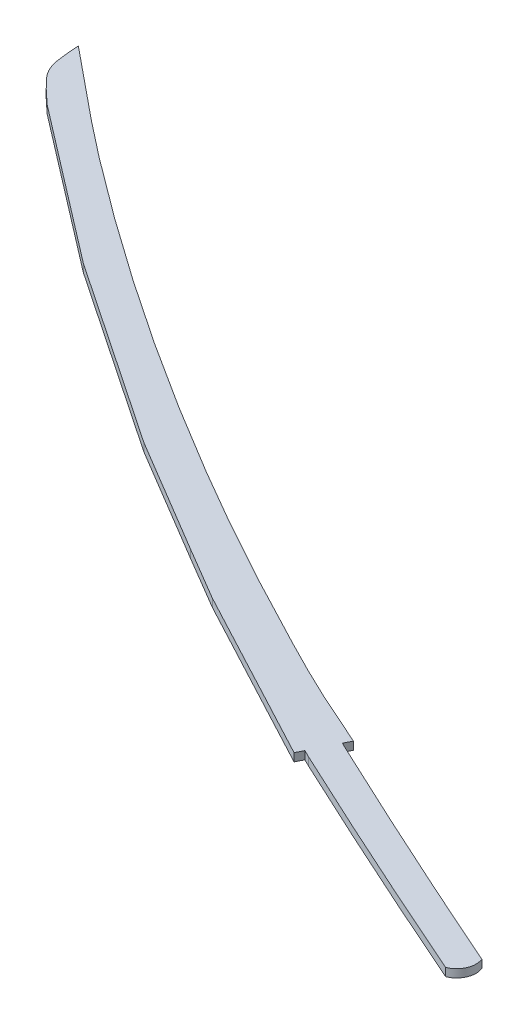
ISO-10303-21;
HEADER;
FILE_DESCRIPTION(('STEP AP214'),'2;1');
FILE_NAME('part.step','',(''),(''),'','','');
FILE_SCHEMA(('AUTOMOTIVE_DESIGN { 1 0 10303 214 1 1 1 1 }'));
ENDSEC;
DATA;
#1=APPLICATION_CONTEXT('core data for automotive mechanical design processes');
#2=APPLICATION_PROTOCOL_DEFINITION('international standard','automotive_design',2000,#1);
#3=PRODUCT_CONTEXT('',#1,'mechanical');
#4=PRODUCT('Part','Part','',(#3));
#5=PRODUCT_RELATED_PRODUCT_CATEGORY('part','',(#4));
#6=PRODUCT_DEFINITION_FORMATION('','',#4);
#7=PRODUCT_DEFINITION_CONTEXT('part definition',#1,'design');
#8=PRODUCT_DEFINITION('design','',#6,#7);
#9=PRODUCT_DEFINITION_SHAPE('','',#8);
#10=(LENGTH_UNIT() NAMED_UNIT(*) SI_UNIT(.MILLI.,.METRE.));
#11=(NAMED_UNIT(*) PLANE_ANGLE_UNIT() SI_UNIT($,.RADIAN.));
#12=(NAMED_UNIT(*) SI_UNIT($,.STERADIAN.) SOLID_ANGLE_UNIT());
#13=UNCERTAINTY_MEASURE_WITH_UNIT(LENGTH_MEASURE(1.E-05),#10,'distance_accuracy_value','');
#14=(GEOMETRIC_REPRESENTATION_CONTEXT(3) GLOBAL_UNCERTAINTY_ASSIGNED_CONTEXT((#13)) GLOBAL_UNIT_ASSIGNED_CONTEXT((#10,
#11,#12)) REPRESENTATION_CONTEXT('',''));
#15=CARTESIAN_POINT('',(0.,0.,0.));
#16=DIRECTION('',(0.,0.,1.));
#17=DIRECTION('',(1.,0.,0.));
#18=AXIS2_PLACEMENT_3D('',#15,#16,#17);
#19=CARTESIAN_POINT('',(42.035523096357,6.35,65.1986253078703));
#20=CARTESIAN_POINT('',(34.8092546586514,6.35,57.7833745415171));
#21=CARTESIAN_POINT('',(26.0365702999491,6.35,51.6099033801397));
#22=CARTESIAN_POINT('',(20.35671778324,6.35,42.9528730088102));
#23=CARTESIAN_POINT('',(14.7218994955774,6.35,34.3644822170223));
#24=CARTESIAN_POINT('',(15.1679157096741,6.35,22.9825376753222));
#25=CARTESIAN_POINT('',(14.2195990873911,6.35,12.7545208044252));
#26=B_SPLINE_CURVE_WITH_KNOTS('',3,(#19,#20,#21,#22,#23,#24,#25),.UNSPECIFIED.,.F.,.F.,(4,3,4),
(0.,1.,2.),.UNSPECIFIED.);
#27=DIRECTION('',(0.,-1.,0.));
#28=VECTOR('',#27,1.);
#29=SURFACE_OF_LINEAR_EXTRUSION('',#26,#28);
#30=CARTESIAN_POINT('',(42.035523096357,0.,65.1986253078703));
#31=CARTESIAN_POINT('',(34.8092546586514,0.,57.7833745415171));
#32=CARTESIAN_POINT('',(26.0365702999491,0.,51.6099033801397));
#33=CARTESIAN_POINT('',(20.35671778324,0.,42.9528730088102));
#34=CARTESIAN_POINT('',(14.7218994955774,0.,34.3644822170223));
#35=CARTESIAN_POINT('',(15.1679157096741,0.,22.9825376753222));
#36=CARTESIAN_POINT('',(14.2195990873911,0.,12.7545208044252));
#37=B_SPLINE_CURVE_WITH_KNOTS('',3,(#30,#31,#32,#33,#34,#35,#36),.UNSPECIFIED.,.F.,.F.,(4,3,4),
(0.,1.,2.),.UNSPECIFIED.);
#38=CARTESIAN_POINT('',(42.035523096357,0.,65.1986253078703));
#39=VERTEX_POINT('',#38);
#40=CARTESIAN_POINT('',(14.2195990873911,0.,12.7545208044252));
#41=VERTEX_POINT('',#40);
#42=EDGE_CURVE('E318',#39,#41,#37,.T.);
#43=ORIENTED_EDGE('',*,*,#42,.F.);
#44=DIRECTION('',(0.,-1.,0.));
#45=VECTOR('',#44,1.);
#46=CARTESIAN_POINT('',(42.035523096357,6.35,65.1986253078703));
#47=LINE('',#46,#45);
#48=CARTESIAN_POINT('',(42.035523096357,6.35,65.1986253078703));
#49=VERTEX_POINT('',#48);
#50=EDGE_CURVE('E12',#49,#39,#47,.T.);
#51=ORIENTED_EDGE('',*,*,#50,.F.);
#52=CARTESIAN_POINT('',(14.2195990873911,6.35,12.7545208044252));
#53=VERTEX_POINT('',#52);
#54=EDGE_CURVE('E243',#49,#53,#26,.T.);
#55=ORIENTED_EDGE('',*,*,#54,.T.);
#56=DIRECTION('',(0.,-1.,0.));
#57=VECTOR('',#56,1.);
#58=CARTESIAN_POINT('',(14.2195990873911,6.35,12.7545208044252));
#59=LINE('',#58,#57);
#60=EDGE_CURVE('E62',#53,#41,#59,.T.);
#61=ORIENTED_EDGE('',*,*,#60,.T.);
#62=EDGE_LOOP('',(#43,#51,#55,#61));
#63=FACE_BOUND('',#62,.T.);
#64=ADVANCED_FACE('F44',(#63),#29,.T.);
#65=CARTESIAN_POINT('',(-15.9135943433382,6.35,20.7445061173763));
#66=DIRECTION('',(-0.608659712115637,0.,0.793431380049535));
#67=DIRECTION('',(0.793431380049535,0.,0.608659712115637));
#68=AXIS2_PLACEMENT_3D('',#65,#66,#67);
#69=PLANE('',#68);
#70=DIRECTION('',(-0.793431380049535,0.,-0.608659712115637));
#71=VECTOR('',#70,1.);
#72=CARTESIAN_POINT('',(-15.9135943433382,0.,20.7445061173763));
#73=LINE('',#72,#71);
#74=CARTESIAN_POINT('',(164.740942363501,0.,159.328813556166));
#75=VERTEX_POINT('',#74);
#76=EDGE_CURVE('E315',#75,#39,#73,.T.);
#77=ORIENTED_EDGE('',*,*,#76,.F.);
#78=DIRECTION('',(0.,-1.,0.));
#79=VECTOR('',#78,1.);
#80=CARTESIAN_POINT('',(164.740942363501,6.35,159.328813556166));
#81=LINE('',#80,#79);
#82=CARTESIAN_POINT('',(164.740942363501,6.35,159.328813556166));
#83=VERTEX_POINT('',#82);
#84=EDGE_CURVE('E54',#83,#75,#81,.T.);
#85=ORIENTED_EDGE('',*,*,#84,.F.);
#86=DIRECTION('',(-0.793431380049535,0.,-0.608659712115637));
#87=VECTOR('',#86,1.);
#88=CARTESIAN_POINT('',(-15.9135943433382,6.35,20.7445061173763));
#89=LINE('',#88,#87);
#90=EDGE_CURVE('E239',#83,#49,#89,.T.);
#91=ORIENTED_EDGE('',*,*,#90,.T.);
#92=ORIENTED_EDGE('',*,*,#50,.T.);
#93=EDGE_LOOP('',(#77,#85,#91,#92));
#94=FACE_BOUND('',#93,.T.);
#95=ADVANCED_FACE('F316',(#94),#69,.T.);
#96=CARTESIAN_POINT('',(-22.3979928883783,6.35,33.2437091702958));
#97=DIRECTION('',(-0.558761224486034,0.,0.829328580244808));
#98=DIRECTION('',(0.829328580244808,0.,0.558761224486034));
#99=AXIS2_PLACEMENT_3D('',#96,#97,#98);
#100=PLANE('',#99);
#101=DIRECTION('',(-0.829328580244808,0.,-0.558761224486034));
#102=VECTOR('',#101,1.);
#103=CARTESIAN_POINT('',(-22.3979928883783,0.,33.2437091702958));
#104=LINE('',#103,#102);
#105=CARTESIAN_POINT('',(311.103839714367,0.,257.94100863927));
#106=VERTEX_POINT('',#105);
#107=EDGE_CURVE('E309',#106,#75,#104,.T.);
#108=ORIENTED_EDGE('',*,*,#107,.F.);
#109=DIRECTION('',(0.,-1.,0.));
#110=VECTOR('',#109,1.);
#111=CARTESIAN_POINT('',(311.103839714367,6.35,257.94100863927));
#112=LINE('',#111,#110);
#113=CARTESIAN_POINT('',(311.103839714367,6.35,257.94100863927));
#114=VERTEX_POINT('',#113);
#115=EDGE_CURVE('E300',#114,#106,#112,.T.);
#116=ORIENTED_EDGE('',*,*,#115,.F.);
#117=DIRECTION('',(-0.829328580244808,0.,-0.558761224486034));
#118=VECTOR('',#117,1.);
#119=CARTESIAN_POINT('',(-22.3979928883783,6.35,33.2437091702958));
#120=LINE('',#119,#118);
#121=EDGE_CURVE('E233',#114,#83,#120,.T.);
#122=ORIENTED_EDGE('',*,*,#121,.T.);
#123=ORIENTED_EDGE('',*,*,#84,.T.);
#124=EDGE_LOOP('',(#108,#116,#122,#123));
#125=FACE_BOUND('',#124,.T.);
#126=ADVANCED_FACE('F307',(#125),#100,.T.);
#127=CARTESIAN_POINT('',(-31.8381402136138,6.35,53.374498192462));
#128=DIRECTION('',(-0.51228684881937,0.,0.858814406333941));
#129=DIRECTION('',(0.858814406333941,0.,0.51228684881937));
#130=AXIS2_PLACEMENT_3D('',#127,#128,#129);
#131=PLANE('',#130);
#132=DIRECTION('',(-0.858814406333941,0.,-0.51228684881937));
#133=VECTOR('',#132,1.);
#134=CARTESIAN_POINT('',(-31.8381402136138,0.,53.374498192462));
#135=LINE('',#134,#133);
#136=CARTESIAN_POINT('',(402.295387023258,0.,312.337197228203));
#137=VERTEX_POINT('',#136);
#138=EDGE_CURVE('E323',#137,#106,#135,.T.);
#139=ORIENTED_EDGE('',*,*,#138,.F.);
#140=DIRECTION('',(0.,-1.,0.));
#141=VECTOR('',#140,1.);
#142=CARTESIAN_POINT('',(402.295387023258,6.35,312.337197228203));
#143=LINE('',#142,#141);
#144=CARTESIAN_POINT('',(402.295387023258,6.35,312.337197228203));
#145=VERTEX_POINT('',#144);
#146=EDGE_CURVE('E297',#145,#137,#143,.T.);
#147=ORIENTED_EDGE('',*,*,#146,.F.);
#148=DIRECTION('',(-0.858814406333941,0.,-0.51228684881937));
#149=VECTOR('',#148,1.);
#150=CARTESIAN_POINT('',(-31.8381402136138,6.35,53.374498192462));
#151=LINE('',#150,#149);
#152=EDGE_CURVE('E228',#145,#114,#151,.T.);
#153=ORIENTED_EDGE('',*,*,#152,.T.);
#154=ORIENTED_EDGE('',*,*,#115,.T.);
#155=EDGE_LOOP('',(#139,#147,#153,#154));
#156=FACE_BOUND('',#155,.T.);
#157=ADVANCED_FACE('F393',(#156),#131,.T.);
#158=CARTESIAN_POINT('',(-32.6831092042224,6.35,55.3113653613439));
#159=DIRECTION('',(0.508719166380983,0.,-0.860932523347003));
#160=DIRECTION('',(-0.860932523347003,0.,-0.508719166380983));
#161=AXIS2_PLACEMENT_3D('',#158,#159,#160);
#162=PLANE('',#161);
#163=DIRECTION('',(0.860932523347003,0.,0.508719166380983));
#164=VECTOR('',#163,1.);
#165=CARTESIAN_POINT('',(-32.6831092042224,0.,55.3113653613439));
#166=LINE('',#165,#164);
#167=CARTESIAN_POINT('',(444.65812899431,0.,337.36905303189));
#168=VERTEX_POINT('',#167);
#169=EDGE_CURVE('E327',#137,#168,#166,.T.);
#170=ORIENTED_EDGE('',*,*,#169,.T.);
#171=DIRECTION('',(0.,-1.,0.));
#172=VECTOR('',#171,1.);
#173=CARTESIAN_POINT('',(444.65812899431,6.35,337.36905303189));
#174=LINE('',#173,#172);
#175=CARTESIAN_POINT('',(444.65812899431,6.35,337.36905303189));
#176=VERTEX_POINT('',#175);
#177=EDGE_CURVE('E293',#176,#168,#174,.T.);
#178=ORIENTED_EDGE('',*,*,#177,.F.);
#179=DIRECTION('',(0.860932523347003,0.,0.508719166380983));
#180=VECTOR('',#179,1.);
#181=CARTESIAN_POINT('',(-32.6831092042224,6.35,55.3113653613439));
#182=LINE('',#181,#180);
#183=EDGE_CURVE('E224',#145,#176,#182,.T.);
#184=ORIENTED_EDGE('',*,*,#183,.F.);
#185=ORIENTED_EDGE('',*,*,#146,.T.);
#186=EDGE_LOOP('',(#170,#178,#184,#185));
#187=FACE_BOUND('',#186,.T.);
#188=ADVANCED_FACE('F390',(#187),#162,.F.);
#189=CARTESIAN_POINT('',(-41.7724510207591,6.35,78.4898930434949));
#190=DIRECTION('',(0.469810277858939,0.,-0.882767411506625));
#191=DIRECTION('',(-0.882767411506625,0.,-0.469810277858939));
#192=AXIS2_PLACEMENT_3D('',#189,#190,#191);
#193=PLANE('',#192);
#194=DIRECTION('',(0.882767411506625,0.,0.469810277858939));
#195=VECTOR('',#194,1.);
#196=CARTESIAN_POINT('',(-41.7724510207591,0.,78.4898930434949));
#197=LINE('',#196,#195);
#198=CARTESIAN_POINT('',(582.444322769918,0.,410.699093469567));
#199=VERTEX_POINT('',#198);
#200=EDGE_CURVE('E332',#168,#199,#197,.T.);
#201=ORIENTED_EDGE('',*,*,#200,.T.);
#202=DIRECTION('',(0.,-1.,0.));
#203=VECTOR('',#202,1.);
#204=CARTESIAN_POINT('',(582.444322769918,6.35,410.699093469567));
#205=LINE('',#204,#203);
#206=CARTESIAN_POINT('',(582.444322769918,6.35,410.699093469567));
#207=VERTEX_POINT('',#206);
#208=EDGE_CURVE('E289',#207,#199,#205,.T.);
#209=ORIENTED_EDGE('',*,*,#208,.F.);
#210=DIRECTION('',(0.882767411506625,0.,0.469810277858939));
#211=VECTOR('',#210,1.);
#212=CARTESIAN_POINT('',(-41.7724510207591,6.35,78.4898930434949));
#213=LINE('',#212,#211);
#214=EDGE_CURVE('E221',#176,#207,#213,.T.);
#215=ORIENTED_EDGE('',*,*,#214,.F.);
#216=ORIENTED_EDGE('',*,*,#177,.T.);
#217=EDGE_LOOP('',(#201,#209,#215,#216));
#218=FACE_BOUND('',#217,.T.);
#219=ADVANCED_FACE('F385',(#218),#193,.F.);
#220=CARTESIAN_POINT('',(631.446830461723,6.35,311.302169059645));
#221=DIRECTION('',(-0.896925106405758,0.,-0.442182488910428));
#222=DIRECTION('',(-0.442182488910428,0.,0.896925106405758));
#223=AXIS2_PLACEMENT_3D('',#220,#221,#222);
#224=PLANE('',#223);
#225=DIRECTION('',(0.442182488910428,0.,-0.896925106405758));
#226=VECTOR('',#225,1.);
#227=CARTESIAN_POINT('',(631.446830461723,0.,311.302169059645));
#228=LINE('',#227,#226);
#229=CARTESIAN_POINT('',(585.262595532021,0.,404.982495321914));
#230=VERTEX_POINT('',#229);
#231=EDGE_CURVE('E335',#199,#230,#228,.T.);
#232=ORIENTED_EDGE('',*,*,#231,.T.);
#233=DIRECTION('',(0.,-1.,0.));
#234=VECTOR('',#233,1.);
#235=CARTESIAN_POINT('',(585.262595532021,6.35,404.982495321914));
#236=LINE('',#235,#234);
#237=CARTESIAN_POINT('',(585.262595532021,6.35,404.982495321914));
#238=VERTEX_POINT('',#237);
#239=EDGE_CURVE('E285',#238,#230,#236,.T.);
#240=ORIENTED_EDGE('',*,*,#239,.F.);
#241=DIRECTION('',(0.442182488910428,0.,-0.896925106405758));
#242=VECTOR('',#241,1.);
#243=CARTESIAN_POINT('',(631.446830461723,6.35,311.302169059645));
#244=LINE('',#243,#242);
#245=EDGE_CURVE('E213',#207,#238,#244,.T.);
#246=ORIENTED_EDGE('',*,*,#245,.F.);
#247=ORIENTED_EDGE('',*,*,#208,.T.);
#248=EDGE_LOOP('',(#232,#240,#246,#247));
#249=FACE_BOUND('',#248,.T.);
#250=ADVANCED_FACE('F381',(#249),#224,.F.);
#251=CARTESIAN_POINT('',(-46.1842349286018,6.35,93.6803262588445));
#252=DIRECTION('',(0.442182488914961,0.,-0.896925106403523));
#253=DIRECTION('',(-0.896925106403523,0.,-0.442182488914961));
#254=AXIS2_PLACEMENT_3D('',#251,#252,#253);
#255=PLANE('',#254);
#256=DIRECTION('',(0.896925106403523,0.,0.442182488914961));
#257=VECTOR('',#256,1.);
#258=CARTESIAN_POINT('',(-46.1842349286018,0.,93.6803262588445));
#259=LINE('',#258,#257);
#260=CARTESIAN_POINT('',(591.036734946634,0.,407.829135826754));
#261=VERTEX_POINT('',#260);
#262=EDGE_CURVE('E338',#230,#261,#259,.T.);
#263=ORIENTED_EDGE('',*,*,#262,.T.);
#264=DIRECTION('',(0.,-1.,0.));
#265=VECTOR('',#264,1.);
#266=CARTESIAN_POINT('',(591.036734946634,6.35,407.829135826754));
#267=LINE('',#266,#265);
#268=CARTESIAN_POINT('',(591.036734946634,6.35,407.829135826754));
#269=VERTEX_POINT('',#268);
#270=EDGE_CURVE('E282',#269,#261,#267,.T.);
#271=ORIENTED_EDGE('',*,*,#270,.F.);
#272=DIRECTION('',(0.896925106403523,0.,0.442182488914961));
#273=VECTOR('',#272,1.);
#274=CARTESIAN_POINT('',(-46.1842349286018,6.35,93.6803262588445));
#275=LINE('',#274,#273);
#276=EDGE_CURVE('E209',#238,#269,#275,.T.);
#277=ORIENTED_EDGE('',*,*,#276,.F.);
#278=ORIENTED_EDGE('',*,*,#239,.T.);
#279=EDGE_LOOP('',(#263,#271,#277,#278));
#280=FACE_BOUND('',#279,.T.);
#281=ADVANCED_FACE('F377',(#280),#255,.F.);
#282=CARTESIAN_POINT('',(4086.11606212443,6.35,-7033.10129374664));
#283=DIRECTION('',(0.,-1.,0.));
#284=DIRECTION('',(0.,0.,-1.));
#285=AXIS2_PLACEMENT_3D('',#282,#283,#284);
#286=CYLINDRICAL_SURFACE('',#285,8220.88956020071);
#287=CARTESIAN_POINT('',(4086.11606212443,0.,-7033.10129374664));
#288=DIRECTION('',(0.,1.,0.));
#289=DIRECTION('',(0.,0.,1.));
#290=AXIS2_PLACEMENT_3D('',#287,#288,#289);
#291=CIRCLE('',#290,8220.88956020071);
#292=CARTESIAN_POINT('',(789.062370590117,0.,497.666403915853));
#293=VERTEX_POINT('',#292);
#294=EDGE_CURVE('E342',#293,#261,#291,.F.);
#295=ORIENTED_EDGE('',*,*,#294,.F.);
#296=DIRECTION('',(0.,-1.,0.));
#297=VECTOR('',#296,1.);
#298=CARTESIAN_POINT('',(789.062370590117,6.35,497.666403915853));
#299=LINE('',#298,#297);
#300=CARTESIAN_POINT('',(789.062370590117,6.35,497.666403915853));
#301=VERTEX_POINT('',#300);
#302=EDGE_CURVE('E279',#301,#293,#299,.T.);
#303=ORIENTED_EDGE('',*,*,#302,.F.);
#304=CARTESIAN_POINT('',(4086.11606212443,6.35,-7033.10129374664));
#305=DIRECTION('',(0.,1.,0.));
#306=DIRECTION('',(0.,0.,1.));
#307=AXIS2_PLACEMENT_3D('',#304,#305,#306);
#308=CIRCLE('',#307,8220.88956020071);
#309=EDGE_CURVE('E205',#301,#269,#308,.F.);
#310=ORIENTED_EDGE('',*,*,#309,.T.);
#311=ORIENTED_EDGE('',*,*,#270,.T.);
#312=EDGE_LOOP('',(#295,#303,#310,#311));
#313=FACE_BOUND('',#312,.T.);
#314=ADVANCED_FACE('F372',(#313),#286,.T.);
#315=CARTESIAN_POINT('',(783.488720992686,6.35,483.411666293144));
#316=DIRECTION('',(0.,-1.,0.));
#317=DIRECTION('',(0.,0.,-1.));
#318=AXIS2_PLACEMENT_3D('',#315,#316,#317);
#319=CYLINDRICAL_SURFACE('',#318,15.3056562919469);
#320=CARTESIAN_POINT('',(783.488720992686,0.,483.411666293144));
#321=DIRECTION('',(0.,1.,0.));
#322=DIRECTION('',(0.,0.,1.));
#323=AXIS2_PLACEMENT_3D('',#320,#321,#322);
#324=CIRCLE('',#323,15.3056562919469);
#325=CARTESIAN_POINT('',(797.743458615395,0.,477.838016695714));
#326=VERTEX_POINT('',#325);
#327=EDGE_CURVE('E346',#326,#293,#324,.F.);
#328=ORIENTED_EDGE('',*,*,#327,.F.);
#329=DIRECTION('',(0.,-1.,0.));
#330=VECTOR('',#329,1.);
#331=CARTESIAN_POINT('',(797.743458615395,6.35,477.838016695714));
#332=LINE('',#331,#330);
#333=CARTESIAN_POINT('',(797.743458615395,6.35,477.838016695714));
#334=VERTEX_POINT('',#333);
#335=EDGE_CURVE('E276',#334,#326,#332,.T.);
#336=ORIENTED_EDGE('',*,*,#335,.F.);
#337=CARTESIAN_POINT('',(783.488720992686,6.35,483.411666293144));
#338=DIRECTION('',(0.,1.,0.));
#339=DIRECTION('',(0.,0.,1.));
#340=AXIS2_PLACEMENT_3D('',#337,#338,#339);
#341=CIRCLE('',#340,15.3056562919469);
#342=EDGE_CURVE('E201',#334,#301,#341,.F.);
#343=ORIENTED_EDGE('',*,*,#342,.T.);
#344=ORIENTED_EDGE('',*,*,#302,.T.);
#345=EDGE_LOOP('',(#328,#336,#343,#344));
#346=FACE_BOUND('',#345,.T.);
#347=ADVANCED_FACE('F367',(#346),#319,.T.);
#348=CARTESIAN_POINT('',(4120.06001950639,6.35,-7062.64052415234));
#349=DIRECTION('',(0.,-1.,0.));
#350=DIRECTION('',(0.,0.,-1.));
#351=AXIS2_PLACEMENT_3D('',#348,#349,#350);
#352=CYLINDRICAL_SURFACE('',#351,8239.9395602007);
#353=CARTESIAN_POINT('',(4120.06001950639,0.,-7062.64052415234));
#354=DIRECTION('',(0.,1.,0.));
#355=DIRECTION('',(0.,0.,1.));
#356=AXIS2_PLACEMENT_3D('',#353,#354,#355);
#357=CIRCLE('',#356,8239.9395602007);
#358=CARTESIAN_POINT('',(601.081783673902,0.,388.0907239533));
#359=VERTEX_POINT('',#358);
#360=EDGE_CURVE('E350',#359,#326,#357,.T.);
#361=ORIENTED_EDGE('',*,*,#360,.F.);
#362=DIRECTION('',(0.,-1.,0.));
#363=VECTOR('',#362,1.);
#364=CARTESIAN_POINT('',(601.081783673902,6.35,388.0907239533));
#365=LINE('',#364,#363);
#366=CARTESIAN_POINT('',(601.081783673902,6.35,388.0907239533));
#367=VERTEX_POINT('',#366);
#368=EDGE_CURVE('E273',#367,#359,#365,.T.);
#369=ORIENTED_EDGE('',*,*,#368,.F.);
#370=CARTESIAN_POINT('',(4120.06001950639,6.35,-7062.64052415234));
#371=DIRECTION('',(0.,1.,0.));
#372=DIRECTION('',(0.,0.,1.));
#373=AXIS2_PLACEMENT_3D('',#370,#371,#372);
#374=CIRCLE('',#373,8239.9395602007);
#375=EDGE_CURVE('E196',#367,#334,#374,.T.);
#376=ORIENTED_EDGE('',*,*,#375,.T.);
#377=ORIENTED_EDGE('',*,*,#335,.T.);
#378=EDGE_LOOP('',(#361,#369,#376,#377));
#379=FACE_BOUND('',#378,.T.);
#380=ADVANCED_FACE('F363',(#379),#352,.F.);
#381=CARTESIAN_POINT('',(-36.3918287560615,6.35,73.8173620573716));
#382=DIRECTION('',(0.442182488910426,0.,-0.896925106405759));
#383=DIRECTION('',(-0.896925106405759,0.,-0.442182488910426));
#384=AXIS2_PLACEMENT_3D('',#381,#382,#383);
#385=PLANE('',#384);
#386=DIRECTION('',(0.896925106405759,0.,0.442182488910426));
#387=VECTOR('',#386,1.);
#388=CARTESIAN_POINT('',(-36.3918287560615,0.,73.8173620573716));
#389=LINE('',#388,#387);
#390=CARTESIAN_POINT('',(595.055001705662,0.,385.119531117015));
#391=VERTEX_POINT('',#390);
#392=EDGE_CURVE('E354',#391,#359,#389,.T.);
#393=ORIENTED_EDGE('',*,*,#392,.F.);
#394=DIRECTION('',(0.,-1.,0.));
#395=VECTOR('',#394,1.);
#396=CARTESIAN_POINT('',(595.055001705662,6.35,385.119531117015));
#397=LINE('',#396,#395);
#398=CARTESIAN_POINT('',(595.055001705662,6.35,385.119531117015));
#399=VERTEX_POINT('',#398);
#400=EDGE_CURVE('E175',#399,#391,#397,.T.);
#401=ORIENTED_EDGE('',*,*,#400,.F.);
#402=DIRECTION('',(0.896925106405759,0.,0.442182488910426));
#403=VECTOR('',#402,1.);
#404=CARTESIAN_POINT('',(-36.3918287560615,6.35,73.8173620573716));
#405=LINE('',#404,#403);
#406=EDGE_CURVE('E163',#399,#367,#405,.T.);
#407=ORIENTED_EDGE('',*,*,#406,.T.);
#408=ORIENTED_EDGE('',*,*,#368,.T.);
#409=EDGE_LOOP('',(#393,#401,#407,#408));
#410=FACE_BOUND('',#409,.T.);
#411=ADVANCED_FACE('F361',(#410),#385,.T.);
#412=CARTESIAN_POINT('',(631.44683046172,6.35,311.302169059652));
#413=DIRECTION('',(-0.896925106405753,0.,-0.442182488910436));
#414=DIRECTION('',(-0.442182488910437,0.,0.896925106405753));
#415=AXIS2_PLACEMENT_3D('',#412,#413,#414);
#416=PLANE('',#415);
#417=DIRECTION('',(0.442182488910436,0.,-0.896925106405753));
#418=VECTOR('',#417,1.);
#419=CARTESIAN_POINT('',(631.44683046172,0.,311.302169059652));
#420=LINE('',#419,#418);
#421=CARTESIAN_POINT('',(597.91579178358,0.,379.316690639628));
#422=VERTEX_POINT('',#421);
#423=EDGE_CURVE('E171',#391,#422,#420,.T.);
#424=ORIENTED_EDGE('',*,*,#423,.T.);
#425=DIRECTION('',(0.,-1.,0.));
#426=VECTOR('',#425,1.);
#427=CARTESIAN_POINT('',(597.91579178358,6.35,379.316690639628));
#428=LINE('',#427,#426);
#429=CARTESIAN_POINT('',(597.91579178358,6.35,379.316690639628));
#430=VERTEX_POINT('',#429);
#431=EDGE_CURVE('E168',#430,#422,#428,.T.);
#432=ORIENTED_EDGE('',*,*,#431,.F.);
#433=DIRECTION('',(0.442182488910436,0.,-0.896925106405753));
#434=VECTOR('',#433,1.);
#435=CARTESIAN_POINT('',(631.44683046172,6.35,311.302169059652));
#436=LINE('',#435,#434);
#437=EDGE_CURVE('E155',#399,#430,#436,.T.);
#438=ORIENTED_EDGE('',*,*,#437,.F.);
#439=ORIENTED_EDGE('',*,*,#400,.T.);
#440=EDGE_LOOP('',(#424,#432,#438,#439));
#441=FACE_BOUND('',#440,.T.);
#442=ADVANCED_FACE('F169',(#441),#416,.F.);
#443=CARTESIAN_POINT('',(-42.0275770099411,6.35,94.3954525678143));
#444=DIRECTION('',(0.406736754245444,0.,-0.913545408146678));
#445=DIRECTION('',(-0.913545408146678,0.,-0.406736754245445));
#446=AXIS2_PLACEMENT_3D('',#443,#444,#445);
#447=PLANE('',#446);
#448=DIRECTION('',(0.913545408146678,0.,0.406736754245445));
#449=VECTOR('',#448,1.);
#450=CARTESIAN_POINT('',(-42.0275770099411,0.,94.3954525678143));
#451=LINE('',#450,#449);
#452=CARTESIAN_POINT('',(557.250361790737,0.,361.211268776867));
#453=VERTEX_POINT('',#452);
#454=EDGE_CURVE('E255',#453,#422,#451,.T.);
#455=ORIENTED_EDGE('',*,*,#454,.F.);
#456=DIRECTION('',(0.,-1.,0.));
#457=VECTOR('',#456,1.);
#458=CARTESIAN_POINT('',(557.250361790737,6.35,361.211268776867));
#459=LINE('',#458,#457);
#460=CARTESIAN_POINT('',(557.250361790737,6.35,361.211268776867));
#461=VERTEX_POINT('',#460);
#462=EDGE_CURVE('E108',#461,#453,#459,.T.);
#463=ORIENTED_EDGE('',*,*,#462,.F.);
#464=DIRECTION('',(0.913545408146678,0.,0.406736754245445));
#465=VECTOR('',#464,1.);
#466=CARTESIAN_POINT('',(-42.0275770099411,6.35,94.3954525678143));
#467=LINE('',#466,#465);
#468=EDGE_CURVE('E160',#461,#430,#467,.T.);
#469=ORIENTED_EDGE('',*,*,#468,.T.);
#470=ORIENTED_EDGE('',*,*,#431,.T.);
#471=EDGE_LOOP('',(#455,#463,#469,#470));
#472=FACE_BOUND('',#471,.T.);
#473=ADVANCED_FACE('F177',(#472),#447,.T.);
#474=CARTESIAN_POINT('',(14.2195990873911,6.35,12.7545208044252));
#475=CARTESIAN_POINT('',(41.2191074702155,6.35,34.552463014036));
#476=CARTESIAN_POINT('',(67.6637565043805,6.35,57.0561555982239));
#477=CARTESIAN_POINT('',(95.2181242358658,6.35,78.1483474332569));
#478=CARTESIAN_POINT('',(189.4496126187,6.35,150.280237710685));
#479=CARTESIAN_POINT('',(288.8783699869,6.35,215.459882208635));
#480=CARTESIAN_POINT('',(391.890489840375,6.35,274.33362881285));
#481=CARTESIAN_POINT('',(427.528344302069,6.35,294.701465297334));
#482=CARTESIAN_POINT('',(463.731566552381,6.35,314.088189459517));
#483=CARTESIAN_POINT('',(500.215864714414,6.35,332.897799272467));
#484=CARTESIAN_POINT('',(519.057164444457,6.35,342.611498429211));
#485=CARTESIAN_POINT('',(537.958168209745,6.35,352.382232004673));
#486=CARTESIAN_POINT('',(557.250361790737,6.35,361.211268776867));
#487=B_SPLINE_CURVE_WITH_KNOTS('',3,(#474,#475,#476,#477,#478,#479,#480,#481,#482,#483,#484,
#485,#486),.UNSPECIFIED.,.F.,.F.,(4,3,3,3,4),(0.,1.,2.,3.,3.59198458904686),.UNSPECIFIED.);
#488=DIRECTION('',(0.,-1.,0.));
#489=VECTOR('',#488,1.);
#490=SURFACE_OF_LINEAR_EXTRUSION('',#487,#489);
#491=CARTESIAN_POINT('',(14.2195990873911,0.,12.7545208044252));
#492=CARTESIAN_POINT('',(41.2191074702155,0.,34.552463014036));
#493=CARTESIAN_POINT('',(67.6637565043805,0.,57.0561555982239));
#494=CARTESIAN_POINT('',(95.2181242358658,0.,78.1483474332569));
#495=CARTESIAN_POINT('',(189.4496126187,0.,150.280237710685));
#496=CARTESIAN_POINT('',(288.8783699869,0.,215.459882208635));
#497=CARTESIAN_POINT('',(391.890489840375,0.,274.33362881285));
#498=CARTESIAN_POINT('',(427.528344302069,0.,294.701465297334));
#499=CARTESIAN_POINT('',(463.731566552381,0.,314.088189459517));
#500=CARTESIAN_POINT('',(500.215864714414,0.,332.897799272467));
#501=CARTESIAN_POINT('',(519.057164444457,0.,342.611498429211));
#502=CARTESIAN_POINT('',(537.958168209745,0.,352.382232004673));
#503=CARTESIAN_POINT('',(557.250361790737,0.,361.211268776867));
#504=B_SPLINE_CURVE_WITH_KNOTS('',3,(#491,#492,#493,#494,#495,#496,#497,#498,#499,#500,#501,
#502,#503),.UNSPECIFIED.,.F.,.F.,(4,3,3,3,4),(0.,1.,2.,3.,3.59198458904686),.UNSPECIFIED.);
#505=EDGE_CURVE('E248',#41,#453,#504,.T.);
#506=ORIENTED_EDGE('',*,*,#505,.F.);
#507=ORIENTED_EDGE('',*,*,#60,.F.);
#508=EDGE_CURVE('E179',#53,#461,#487,.T.);
#509=ORIENTED_EDGE('',*,*,#508,.T.);
#510=ORIENTED_EDGE('',*,*,#462,.T.);
#511=EDGE_LOOP('',(#506,#507,#509,#510));
#512=FACE_BOUND('',#511,.T.);
#513=ADVANCED_FACE('F396',(#512),#490,.T.);
#514=CARTESIAN_POINT('',(0.,6.35,0.));
#515=DIRECTION('',(0.,1.,0.));
#516=DIRECTION('',(0.,0.,1.));
#517=AXIS2_PLACEMENT_3D('',#514,#515,#516);
#518=PLANE('',#517);
#519=ORIENTED_EDGE('',*,*,#54,.F.);
#520=ORIENTED_EDGE('',*,*,#90,.F.);
#521=ORIENTED_EDGE('',*,*,#121,.F.);
#522=ORIENTED_EDGE('',*,*,#152,.F.);
#523=ORIENTED_EDGE('',*,*,#183,.T.);
#524=ORIENTED_EDGE('',*,*,#214,.T.);
#525=ORIENTED_EDGE('',*,*,#245,.T.);
#526=ORIENTED_EDGE('',*,*,#276,.T.);
#527=ORIENTED_EDGE('',*,*,#309,.F.);
#528=ORIENTED_EDGE('',*,*,#342,.F.);
#529=ORIENTED_EDGE('',*,*,#375,.F.);
#530=ORIENTED_EDGE('',*,*,#406,.F.);
#531=ORIENTED_EDGE('',*,*,#437,.T.);
#532=ORIENTED_EDGE('',*,*,#468,.F.);
#533=ORIENTED_EDGE('',*,*,#508,.F.);
#534=EDGE_LOOP('',(#519,#520,#521,#522,#523,#524,#525,#526,#527,#528,#529,#530,#531,#532,#533));
#535=FACE_BOUND('',#534,.T.);
#536=ADVANCED_FACE('F157',(#535),#518,.T.);
#537=CARTESIAN_POINT('',(0.,0.,0.));
#538=DIRECTION('',(0.,1.,0.));
#539=DIRECTION('',(0.,0.,1.));
#540=AXIS2_PLACEMENT_3D('',#537,#538,#539);
#541=PLANE('',#540);
#542=ORIENTED_EDGE('',*,*,#42,.T.);
#543=ORIENTED_EDGE('',*,*,#505,.T.);
#544=ORIENTED_EDGE('',*,*,#454,.T.);
#545=ORIENTED_EDGE('',*,*,#423,.F.);
#546=ORIENTED_EDGE('',*,*,#392,.T.);
#547=ORIENTED_EDGE('',*,*,#360,.T.);
#548=ORIENTED_EDGE('',*,*,#327,.T.);
#549=ORIENTED_EDGE('',*,*,#294,.T.);
#550=ORIENTED_EDGE('',*,*,#262,.F.);
#551=ORIENTED_EDGE('',*,*,#231,.F.);
#552=ORIENTED_EDGE('',*,*,#200,.F.);
#553=ORIENTED_EDGE('',*,*,#169,.F.);
#554=ORIENTED_EDGE('',*,*,#138,.T.);
#555=ORIENTED_EDGE('',*,*,#107,.T.);
#556=ORIENTED_EDGE('',*,*,#76,.T.);
#557=EDGE_LOOP('',(#542,#543,#544,#545,#546,#547,#548,#549,#550,#551,#552,#553,#554,#555,#556));
#558=FACE_BOUND('',#557,.T.);
#559=ADVANCED_FACE('F320',(#558),#541,.F.);
#560=CLOSED_SHELL('',(#64,#95,#126,#157,#188,#219,#250,#281,#314,#347,#380,#411,#442,#473,#513,
#536,#559));
#561=MANIFOLD_SOLID_BREP('B2',#560);
#562=ADVANCED_BREP_SHAPE_REPRESENTATION('',(#18,#561),#14);
#563=SHAPE_DEFINITION_REPRESENTATION(#9,#562);
ENDSEC;
END-ISO-10303-21;
